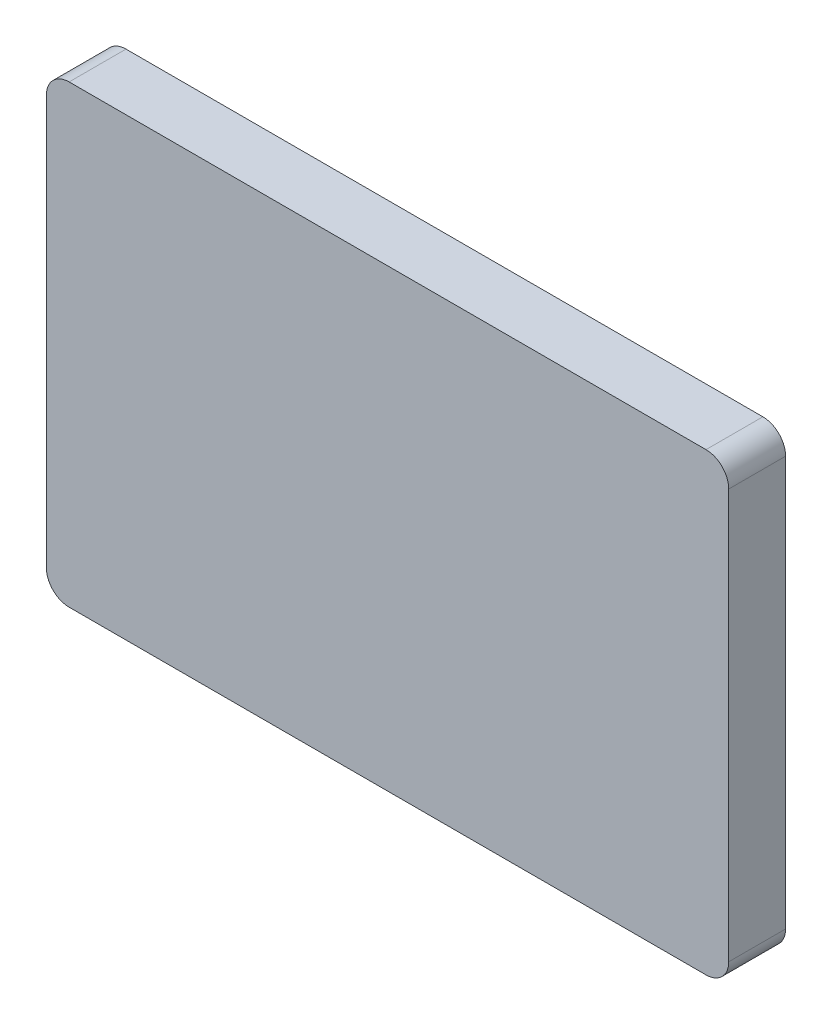
ISO-10303-21;
HEADER;
FILE_DESCRIPTION(('STEP AP214'),'2;1');
FILE_NAME('part.step','',(''),(''),'','','');
FILE_SCHEMA(('AUTOMOTIVE_DESIGN { 1 0 10303 214 1 1 1 1 }'));
ENDSEC;
DATA;
#1=APPLICATION_CONTEXT('core data for automotive mechanical design processes');
#2=APPLICATION_PROTOCOL_DEFINITION('international standard','automotive_design',2000,#1);
#3=PRODUCT_CONTEXT('',#1,'mechanical');
#4=PRODUCT('Part','Part','',(#3));
#5=PRODUCT_RELATED_PRODUCT_CATEGORY('part','',(#4));
#6=PRODUCT_DEFINITION_FORMATION('','',#4);
#7=PRODUCT_DEFINITION_CONTEXT('part definition',#1,'design');
#8=PRODUCT_DEFINITION('design','',#6,#7);
#9=PRODUCT_DEFINITION_SHAPE('','',#8);
#10=(LENGTH_UNIT() NAMED_UNIT(*) SI_UNIT(.MILLI.,.METRE.));
#11=(NAMED_UNIT(*) PLANE_ANGLE_UNIT() SI_UNIT($,.RADIAN.));
#12=(NAMED_UNIT(*) SI_UNIT($,.STERADIAN.) SOLID_ANGLE_UNIT());
#13=UNCERTAINTY_MEASURE_WITH_UNIT(LENGTH_MEASURE(1.E-05),#10,'distance_accuracy_value','');
#14=(GEOMETRIC_REPRESENTATION_CONTEXT(3) GLOBAL_UNCERTAINTY_ASSIGNED_CONTEXT((#13)) GLOBAL_UNIT_ASSIGNED_CONTEXT((#10,
#11,#12)) REPRESENTATION_CONTEXT('',''));
#15=CARTESIAN_POINT('',(0.,0.,0.));
#16=DIRECTION('',(0.,0.,1.));
#17=DIRECTION('',(1.,0.,0.));
#18=AXIS2_PLACEMENT_3D('',#15,#16,#17);
#19=CARTESIAN_POINT('',(38.1,-25.4,6.35));
#20=DIRECTION('',(-1.,0.,0.));
#21=DIRECTION('',(0.,0.,1.));
#22=AXIS2_PLACEMENT_3D('',#19,#20,#21);
#23=PLANE('',#22);
#24=DIRECTION('',(0.,1.,0.));
#25=VECTOR('',#24,1.);
#26=CARTESIAN_POINT('',(38.1,-25.4,6.35));
#27=LINE('',#26,#25);
#28=CARTESIAN_POINT('',(38.1,-22.86,6.35));
#29=VERTEX_POINT('',#28);
#30=CARTESIAN_POINT('',(38.1,22.86,6.35));
#31=VERTEX_POINT('',#30);
#32=EDGE_CURVE('E132',#29,#31,#27,.T.);
#33=ORIENTED_EDGE('',*,*,#32,.F.);
#34=DIRECTION('',(0.,0.,-1.));
#35=VECTOR('',#34,1.);
#36=CARTESIAN_POINT('',(38.1,-22.86,6.35));
#37=LINE('',#36,#35);
#38=CARTESIAN_POINT('',(38.1,-22.86,0.));
#39=VERTEX_POINT('',#38);
#40=EDGE_CURVE('E116',#29,#39,#37,.T.);
#41=ORIENTED_EDGE('',*,*,#40,.T.);
#42=DIRECTION('',(0.,1.,0.));
#43=VECTOR('',#42,1.);
#44=CARTESIAN_POINT('',(38.1,-25.4,0.));
#45=LINE('',#44,#43);
#46=CARTESIAN_POINT('',(38.1,22.86,0.));
#47=VERTEX_POINT('',#46);
#48=EDGE_CURVE('E129',#39,#47,#45,.T.);
#49=ORIENTED_EDGE('',*,*,#48,.T.);
#50=DIRECTION('',(0.,0.,-1.));
#51=VECTOR('',#50,1.);
#52=CARTESIAN_POINT('',(38.1,22.86,6.35));
#53=LINE('',#52,#51);
#54=EDGE_CURVE('E135',#47,#31,#53,.F.);
#55=ORIENTED_EDGE('',*,*,#54,.T.);
#56=EDGE_LOOP('',(#33,#41,#49,#55));
#57=FACE_BOUND('',#56,.T.);
#58=ADVANCED_FACE('F45',(#57),#23,.F.);
#59=CARTESIAN_POINT('',(-38.1,25.4,6.35));
#60=DIRECTION('',(0.,-1.,0.));
#61=DIRECTION('',(0.,0.,-1.));
#62=AXIS2_PLACEMENT_3D('',#59,#60,#61);
#63=PLANE('',#62);
#64=DIRECTION('',(-1.,0.,0.));
#65=VECTOR('',#64,1.);
#66=CARTESIAN_POINT('',(-38.1,25.4,0.));
#67=LINE('',#66,#65);
#68=CARTESIAN_POINT('',(35.56,25.4,0.));
#69=VERTEX_POINT('',#68);
#70=CARTESIAN_POINT('',(-35.56,25.4,0.));
#71=VERTEX_POINT('',#70);
#72=EDGE_CURVE('E140',#69,#71,#67,.T.);
#73=ORIENTED_EDGE('',*,*,#72,.T.);
#74=DIRECTION('',(0.,0.,-1.));
#75=VECTOR('',#74,1.);
#76=CARTESIAN_POINT('',(-35.56,25.4,6.35));
#77=LINE('',#76,#75);
#78=CARTESIAN_POINT('',(-35.56,25.4,6.35));
#79=VERTEX_POINT('',#78);
#80=EDGE_CURVE('E11',#71,#79,#77,.F.);
#81=ORIENTED_EDGE('',*,*,#80,.T.);
#82=DIRECTION('',(-1.,0.,0.));
#83=VECTOR('',#82,1.);
#84=CARTESIAN_POINT('',(-38.1,25.4,6.35));
#85=LINE('',#84,#83);
#86=CARTESIAN_POINT('',(35.56,25.4,6.35));
#87=VERTEX_POINT('',#86);
#88=EDGE_CURVE('E192',#87,#79,#85,.T.);
#89=ORIENTED_EDGE('',*,*,#88,.F.);
#90=DIRECTION('',(0.,0.,-1.));
#91=VECTOR('',#90,1.);
#92=CARTESIAN_POINT('',(35.56,25.4,6.35));
#93=LINE('',#92,#91);
#94=EDGE_CURVE('E54',#87,#69,#93,.T.);
#95=ORIENTED_EDGE('',*,*,#94,.T.);
#96=EDGE_LOOP('',(#73,#81,#89,#95));
#97=FACE_BOUND('',#96,.T.);
#98=ADVANCED_FACE('F190',(#97),#63,.F.);
#99=CARTESIAN_POINT('',(-38.1,-25.4,6.35));
#100=DIRECTION('',(1.,0.,0.));
#101=DIRECTION('',(0.,0.,-1.));
#102=AXIS2_PLACEMENT_3D('',#99,#100,#101);
#103=PLANE('',#102);
#104=DIRECTION('',(0.,-1.,0.));
#105=VECTOR('',#104,1.);
#106=CARTESIAN_POINT('',(-38.1,-25.4,0.));
#107=LINE('',#106,#105);
#108=CARTESIAN_POINT('',(-38.1,22.86,0.));
#109=VERTEX_POINT('',#108);
#110=CARTESIAN_POINT('',(-38.1,-22.86,0.));
#111=VERTEX_POINT('',#110);
#112=EDGE_CURVE('E144',#109,#111,#107,.T.);
#113=ORIENTED_EDGE('',*,*,#112,.T.);
#114=DIRECTION('',(0.,0.,-1.));
#115=VECTOR('',#114,1.);
#116=CARTESIAN_POINT('',(-38.1,-22.86,6.35));
#117=LINE('',#116,#115);
#118=CARTESIAN_POINT('',(-38.1,-22.86,6.35));
#119=VERTEX_POINT('',#118);
#120=EDGE_CURVE('E61',#111,#119,#117,.F.);
#121=ORIENTED_EDGE('',*,*,#120,.T.);
#122=DIRECTION('',(0.,-1.,0.));
#123=VECTOR('',#122,1.);
#124=CARTESIAN_POINT('',(-38.1,-25.4,6.35));
#125=LINE('',#124,#123);
#126=CARTESIAN_POINT('',(-38.1,22.86,6.35));
#127=VERTEX_POINT('',#126);
#128=EDGE_CURVE('E200',#127,#119,#125,.T.);
#129=ORIENTED_EDGE('',*,*,#128,.F.);
#130=DIRECTION('',(0.,0.,-1.));
#131=VECTOR('',#130,1.);
#132=CARTESIAN_POINT('',(-38.1,22.86,6.35));
#133=LINE('',#132,#131);
#134=EDGE_CURVE('E180',#127,#109,#133,.T.);
#135=ORIENTED_EDGE('',*,*,#134,.T.);
#136=EDGE_LOOP('',(#113,#121,#129,#135));
#137=FACE_BOUND('',#136,.T.);
#138=ADVANCED_FACE('F199',(#137),#103,.F.);
#139=CARTESIAN_POINT('',(-38.1,-25.4,6.35));
#140=DIRECTION('',(0.,1.,0.));
#141=DIRECTION('',(0.,0.,1.));
#142=AXIS2_PLACEMENT_3D('',#139,#140,#141);
#143=PLANE('',#142);
#144=DIRECTION('',(1.,0.,0.));
#145=VECTOR('',#144,1.);
#146=CARTESIAN_POINT('',(-38.1,-25.4,0.));
#147=LINE('',#146,#145);
#148=CARTESIAN_POINT('',(-35.56,-25.4,0.));
#149=VERTEX_POINT('',#148);
#150=CARTESIAN_POINT('',(35.56,-25.4,0.));
#151=VERTEX_POINT('',#150);
#152=EDGE_CURVE('E152',#149,#151,#147,.T.);
#153=ORIENTED_EDGE('',*,*,#152,.T.);
#154=DIRECTION('',(0.,0.,-1.));
#155=VECTOR('',#154,1.);
#156=CARTESIAN_POINT('',(35.56,-25.4,6.35));
#157=LINE('',#156,#155);
#158=CARTESIAN_POINT('',(35.56,-25.4,6.35));
#159=VERTEX_POINT('',#158);
#160=EDGE_CURVE('E117',#151,#159,#157,.F.);
#161=ORIENTED_EDGE('',*,*,#160,.T.);
#162=DIRECTION('',(1.,0.,0.));
#163=VECTOR('',#162,1.);
#164=CARTESIAN_POINT('',(-38.1,-25.4,6.35));
#165=LINE('',#164,#163);
#166=CARTESIAN_POINT('',(-35.56,-25.4,6.35));
#167=VERTEX_POINT('',#166);
#168=EDGE_CURVE('E147',#167,#159,#165,.T.);
#169=ORIENTED_EDGE('',*,*,#168,.F.);
#170=DIRECTION('',(0.,0.,-1.));
#171=VECTOR('',#170,1.);
#172=CARTESIAN_POINT('',(-35.56,-25.4,6.35));
#173=LINE('',#172,#171);
#174=EDGE_CURVE('E123',#167,#149,#173,.T.);
#175=ORIENTED_EDGE('',*,*,#174,.T.);
#176=EDGE_LOOP('',(#153,#161,#169,#175));
#177=FACE_BOUND('',#176,.T.);
#178=ADVANCED_FACE('F232',(#177),#143,.F.);
#179=CARTESIAN_POINT('',(0.,0.,6.35));
#180=DIRECTION('',(0.,0.,-1.));
#181=DIRECTION('',(-1.,0.,0.));
#182=AXIS2_PLACEMENT_3D('',#179,#180,#181);
#183=PLANE('',#182);
#184=ORIENTED_EDGE('',*,*,#168,.T.);
#185=CARTESIAN_POINT('',(35.56,-22.86,6.35));
#186=DIRECTION('',(0.,0.,-1.));
#187=DIRECTION('',(-1.,0.,0.));
#188=AXIS2_PLACEMENT_3D('',#185,#186,#187);
#189=CIRCLE('',#188,2.54);
#190=EDGE_CURVE('E177',#159,#29,#189,.F.);
#191=ORIENTED_EDGE('',*,*,#190,.T.);
#192=ORIENTED_EDGE('',*,*,#32,.T.);
#193=CARTESIAN_POINT('',(35.56,22.86,6.35));
#194=DIRECTION('',(0.,0.,-1.));
#195=DIRECTION('',(-1.,0.,0.));
#196=AXIS2_PLACEMENT_3D('',#193,#194,#195);
#197=CIRCLE('',#196,2.54);
#198=EDGE_CURVE('E169',#31,#87,#197,.F.);
#199=ORIENTED_EDGE('',*,*,#198,.T.);
#200=ORIENTED_EDGE('',*,*,#88,.T.);
#201=CARTESIAN_POINT('',(-35.56,22.86,6.35));
#202=DIRECTION('',(0.,0.,-1.));
#203=DIRECTION('',(-1.,0.,0.));
#204=AXIS2_PLACEMENT_3D('',#201,#202,#203);
#205=CIRCLE('',#204,2.54);
#206=EDGE_CURVE('E68',#79,#127,#205,.F.);
#207=ORIENTED_EDGE('',*,*,#206,.T.);
#208=ORIENTED_EDGE('',*,*,#128,.T.);
#209=CARTESIAN_POINT('',(-35.56,-22.86,6.35));
#210=DIRECTION('',(0.,0.,-1.));
#211=DIRECTION('',(-1.,0.,0.));
#212=AXIS2_PLACEMENT_3D('',#209,#210,#211);
#213=CIRCLE('',#212,2.54);
#214=EDGE_CURVE('E174',#119,#167,#213,.F.);
#215=ORIENTED_EDGE('',*,*,#214,.T.);
#216=EDGE_LOOP('',(#184,#191,#192,#199,#200,#207,#208,#215));
#217=FACE_BOUND('',#216,.T.);
#218=ADVANCED_FACE('F209',(#217),#183,.F.);
#219=CARTESIAN_POINT('',(0.,0.,0.));
#220=DIRECTION('',(0.,0.,-1.));
#221=DIRECTION('',(-1.,0.,0.));
#222=AXIS2_PLACEMENT_3D('',#219,#220,#221);
#223=PLANE('',#222);
#224=ORIENTED_EDGE('',*,*,#48,.F.);
#225=CARTESIAN_POINT('',(35.56,-22.86,0.));
#226=DIRECTION('',(0.,0.,-1.));
#227=DIRECTION('',(-1.,0.,0.));
#228=AXIS2_PLACEMENT_3D('',#225,#226,#227);
#229=CIRCLE('',#228,2.54);
#230=EDGE_CURVE('E112',#39,#151,#229,.T.);
#231=ORIENTED_EDGE('',*,*,#230,.T.);
#232=ORIENTED_EDGE('',*,*,#152,.F.);
#233=CARTESIAN_POINT('',(-35.56,-22.86,0.));
#234=DIRECTION('',(0.,0.,-1.));
#235=DIRECTION('',(-1.,0.,0.));
#236=AXIS2_PLACEMENT_3D('',#233,#234,#235);
#237=CIRCLE('',#236,2.54);
#238=EDGE_CURVE('E124',#149,#111,#237,.T.);
#239=ORIENTED_EDGE('',*,*,#238,.T.);
#240=ORIENTED_EDGE('',*,*,#112,.F.);
#241=CARTESIAN_POINT('',(-35.56,22.86,0.));
#242=DIRECTION('',(0.,0.,-1.));
#243=DIRECTION('',(-1.,0.,0.));
#244=AXIS2_PLACEMENT_3D('',#241,#242,#243);
#245=CIRCLE('',#244,2.54);
#246=EDGE_CURVE('E159',#109,#71,#245,.T.);
#247=ORIENTED_EDGE('',*,*,#246,.T.);
#248=ORIENTED_EDGE('',*,*,#72,.F.);
#249=CARTESIAN_POINT('',(35.56,22.86,0.));
#250=DIRECTION('',(0.,0.,-1.));
#251=DIRECTION('',(-1.,0.,0.));
#252=AXIS2_PLACEMENT_3D('',#249,#250,#251);
#253=CIRCLE('',#252,2.54);
#254=EDGE_CURVE('E134',#69,#47,#253,.T.);
#255=ORIENTED_EDGE('',*,*,#254,.T.);
#256=EDGE_LOOP('',(#224,#231,#232,#239,#240,#247,#248,#255));
#257=FACE_BOUND('',#256,.T.);
#258=ADVANCED_FACE('F137',(#257),#223,.T.);
#259=CARTESIAN_POINT('',(35.56,-22.86,6.35));
#260=DIRECTION('',(0.,0.,-1.));
#261=DIRECTION('',(-1.,0.,0.));
#262=AXIS2_PLACEMENT_3D('',#259,#260,#261);
#263=CYLINDRICAL_SURFACE('',#262,2.54);
#264=ORIENTED_EDGE('',*,*,#190,.F.);
#265=ORIENTED_EDGE('',*,*,#160,.F.);
#266=ORIENTED_EDGE('',*,*,#230,.F.);
#267=ORIENTED_EDGE('',*,*,#40,.F.);
#268=EDGE_LOOP('',(#264,#265,#266,#267));
#269=FACE_BOUND('',#268,.T.);
#270=ADVANCED_FACE('F115',(#269),#263,.T.);
#271=CARTESIAN_POINT('',(-35.56,-22.86,6.35));
#272=DIRECTION('',(0.,0.,-1.));
#273=DIRECTION('',(-1.,0.,0.));
#274=AXIS2_PLACEMENT_3D('',#271,#272,#273);
#275=CYLINDRICAL_SURFACE('',#274,2.54);
#276=ORIENTED_EDGE('',*,*,#214,.F.);
#277=ORIENTED_EDGE('',*,*,#120,.F.);
#278=ORIENTED_EDGE('',*,*,#238,.F.);
#279=ORIENTED_EDGE('',*,*,#174,.F.);
#280=EDGE_LOOP('',(#276,#277,#278,#279));
#281=FACE_BOUND('',#280,.T.);
#282=ADVANCED_FACE('F214',(#281),#275,.T.);
#283=CARTESIAN_POINT('',(-35.56,22.86,6.35));
#284=DIRECTION('',(0.,0.,-1.));
#285=DIRECTION('',(-1.,0.,0.));
#286=AXIS2_PLACEMENT_3D('',#283,#284,#285);
#287=CYLINDRICAL_SURFACE('',#286,2.54);
#288=ORIENTED_EDGE('',*,*,#206,.F.);
#289=ORIENTED_EDGE('',*,*,#80,.F.);
#290=ORIENTED_EDGE('',*,*,#246,.F.);
#291=ORIENTED_EDGE('',*,*,#134,.F.);
#292=EDGE_LOOP('',(#288,#289,#290,#291));
#293=FACE_BOUND('',#292,.T.);
#294=ADVANCED_FACE('F198',(#293),#287,.T.);
#295=CARTESIAN_POINT('',(35.56,22.86,6.35));
#296=DIRECTION('',(0.,0.,-1.));
#297=DIRECTION('',(-1.,0.,0.));
#298=AXIS2_PLACEMENT_3D('',#295,#296,#297);
#299=CYLINDRICAL_SURFACE('',#298,2.54);
#300=ORIENTED_EDGE('',*,*,#198,.F.);
#301=ORIENTED_EDGE('',*,*,#54,.F.);
#302=ORIENTED_EDGE('',*,*,#254,.F.);
#303=ORIENTED_EDGE('',*,*,#94,.F.);
#304=EDGE_LOOP('',(#300,#301,#302,#303));
#305=FACE_BOUND('',#304,.T.);
#306=ADVANCED_FACE('F47',(#305),#299,.T.);
#307=CLOSED_SHELL('',(#58,#98,#138,#178,#218,#258,#270,#282,#294,#306));
#308=MANIFOLD_SOLID_BREP('B2',#307);
#309=ADVANCED_BREP_SHAPE_REPRESENTATION('',(#18,#308),#14);
#310=SHAPE_DEFINITION_REPRESENTATION(#9,#309);
ENDSEC;
END-ISO-10303-21;
